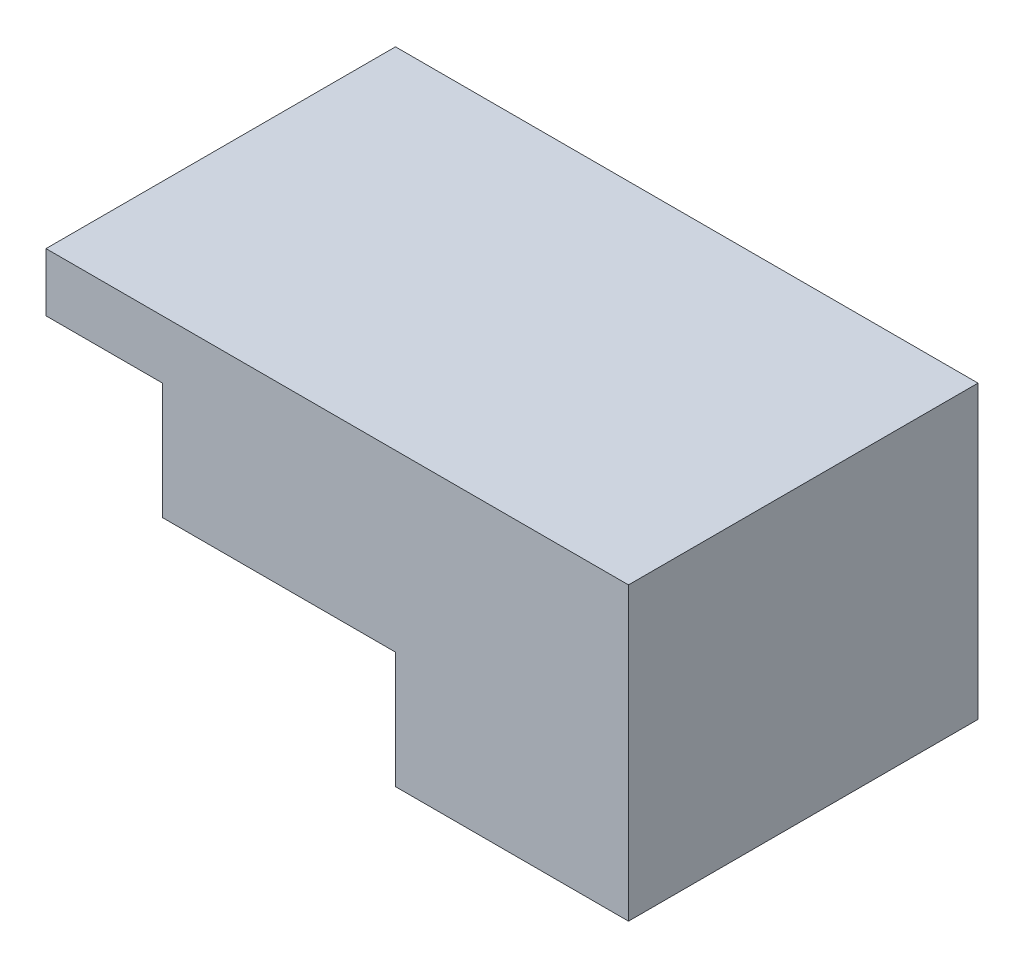
ISO-10303-21;
HEADER;
FILE_DESCRIPTION(('STEP AP214'),'2;1');
FILE_NAME('part.step','',(''),(''),'','','');
FILE_SCHEMA(('AUTOMOTIVE_DESIGN { 1 0 10303 214 1 1 1 1 }'));
ENDSEC;
DATA;
#1=APPLICATION_CONTEXT('core data for automotive mechanical design processes');
#2=APPLICATION_PROTOCOL_DEFINITION('international standard','automotive_design',2000,#1);
#3=PRODUCT_CONTEXT('',#1,'mechanical');
#4=PRODUCT('Part','Part','',(#3));
#5=PRODUCT_RELATED_PRODUCT_CATEGORY('part','',(#4));
#6=PRODUCT_DEFINITION_FORMATION('','',#4);
#7=PRODUCT_DEFINITION_CONTEXT('part definition',#1,'design');
#8=PRODUCT_DEFINITION('design','',#6,#7);
#9=PRODUCT_DEFINITION_SHAPE('','',#8);
#10=(LENGTH_UNIT() NAMED_UNIT(*) SI_UNIT(.MILLI.,.METRE.));
#11=(NAMED_UNIT(*) PLANE_ANGLE_UNIT() SI_UNIT($,.RADIAN.));
#12=(NAMED_UNIT(*) SI_UNIT($,.STERADIAN.) SOLID_ANGLE_UNIT());
#13=UNCERTAINTY_MEASURE_WITH_UNIT(LENGTH_MEASURE(1.E-05),#10,'distance_accuracy_value','');
#14=(GEOMETRIC_REPRESENTATION_CONTEXT(3) GLOBAL_UNCERTAINTY_ASSIGNED_CONTEXT((#13)) GLOBAL_UNIT_ASSIGNED_CONTEXT((#10,
#11,#12)) REPRESENTATION_CONTEXT('',''));
#15=CARTESIAN_POINT('',(0.,0.,0.));
#16=DIRECTION('',(0.,0.,1.));
#17=DIRECTION('',(1.,0.,0.));
#18=AXIS2_PLACEMENT_3D('',#15,#16,#17);
#19=CARTESIAN_POINT('',(-101.6,0.,-152.4));
#20=DIRECTION('',(0.,-1.,0.));
#21=DIRECTION('',(0.,0.,-1.));
#22=AXIS2_PLACEMENT_3D('',#19,#20,#21);
#23=PLANE('',#22);
#24=DIRECTION('',(1.,0.,0.));
#25=VECTOR('',#24,1.);
#26=CARTESIAN_POINT('',(-101.6,0.,0.));
#27=LINE('',#26,#25);
#28=CARTESIAN_POINT('',(-101.6,0.,0.));
#29=VERTEX_POINT('',#28);
#30=CARTESIAN_POINT('',(0.,0.,0.));
#31=VERTEX_POINT('',#30);
#32=EDGE_CURVE('E128',#29,#31,#27,.T.);
#33=ORIENTED_EDGE('',*,*,#32,.F.);
#34=DIRECTION('',(0.,0.,1.));
#35=VECTOR('',#34,1.);
#36=CARTESIAN_POINT('',(-101.6,0.,-152.4));
#37=LINE('',#36,#35);
#38=CARTESIAN_POINT('',(-101.6,0.,-152.4));
#39=VERTEX_POINT('',#38);
#40=EDGE_CURVE('E11',#39,#29,#37,.T.);
#41=ORIENTED_EDGE('',*,*,#40,.F.);
#42=DIRECTION('',(1.,0.,0.));
#43=VECTOR('',#42,1.);
#44=CARTESIAN_POINT('',(-101.6,0.,-152.4));
#45=LINE('',#44,#43);
#46=CARTESIAN_POINT('',(0.,0.,-152.4));
#47=VERTEX_POINT('',#46);
#48=EDGE_CURVE('E148',#39,#47,#45,.T.);
#49=ORIENTED_EDGE('',*,*,#48,.T.);
#50=DIRECTION('',(0.,0.,1.));
#51=VECTOR('',#50,1.);
#52=CARTESIAN_POINT('',(0.,0.,-152.4));
#53=LINE('',#52,#51);
#54=EDGE_CURVE('E34',#47,#31,#53,.T.);
#55=ORIENTED_EDGE('',*,*,#54,.T.);
#56=EDGE_LOOP('',(#33,#41,#49,#55));
#57=FACE_BOUND('',#56,.T.);
#58=ADVANCED_FACE('F31',(#57),#23,.T.);
#59=CARTESIAN_POINT('',(-101.6,50.8,-152.4));
#60=DIRECTION('',(-1.,0.,0.));
#61=DIRECTION('',(0.,0.,1.));
#62=AXIS2_PLACEMENT_3D('',#59,#60,#61);
#63=PLANE('',#62);
#64=DIRECTION('',(0.,-1.,0.));
#65=VECTOR('',#64,1.);
#66=CARTESIAN_POINT('',(-101.6,50.8,0.));
#67=LINE('',#66,#65);
#68=CARTESIAN_POINT('',(-101.6,50.8,0.));
#69=VERTEX_POINT('',#68);
#70=EDGE_CURVE('E146',#69,#29,#67,.T.);
#71=ORIENTED_EDGE('',*,*,#70,.F.);
#72=DIRECTION('',(0.,0.,1.));
#73=VECTOR('',#72,1.);
#74=CARTESIAN_POINT('',(-101.6,50.8,-152.4));
#75=LINE('',#74,#73);
#76=CARTESIAN_POINT('',(-101.6,50.8,-152.4));
#77=VERTEX_POINT('',#76);
#78=EDGE_CURVE('E40',#77,#69,#75,.T.);
#79=ORIENTED_EDGE('',*,*,#78,.F.);
#80=DIRECTION('',(0.,-1.,0.));
#81=VECTOR('',#80,1.);
#82=CARTESIAN_POINT('',(-101.6,50.8,-152.4));
#83=LINE('',#82,#81);
#84=EDGE_CURVE('E118',#77,#39,#83,.T.);
#85=ORIENTED_EDGE('',*,*,#84,.T.);
#86=ORIENTED_EDGE('',*,*,#40,.T.);
#87=EDGE_LOOP('',(#71,#79,#85,#86));
#88=FACE_BOUND('',#87,.T.);
#89=ADVANCED_FACE('F160',(#88),#63,.T.);
#90=CARTESIAN_POINT('',(-152.4,50.8,-152.4));
#91=DIRECTION('',(0.,-1.,0.));
#92=DIRECTION('',(0.,0.,-1.));
#93=AXIS2_PLACEMENT_3D('',#90,#91,#92);
#94=PLANE('',#93);
#95=DIRECTION('',(1.,0.,0.));
#96=VECTOR('',#95,1.);
#97=CARTESIAN_POINT('',(-152.4,50.8,0.));
#98=LINE('',#97,#96);
#99=CARTESIAN_POINT('',(-152.4,50.8,0.));
#100=VERTEX_POINT('',#99);
#101=EDGE_CURVE('E105',#100,#69,#98,.T.);
#102=ORIENTED_EDGE('',*,*,#101,.F.);
#103=DIRECTION('',(0.,0.,1.));
#104=VECTOR('',#103,1.);
#105=CARTESIAN_POINT('',(-152.4,50.8,-152.4));
#106=LINE('',#105,#104);
#107=CARTESIAN_POINT('',(-152.4,50.8,-152.4));
#108=VERTEX_POINT('',#107);
#109=EDGE_CURVE('E100',#108,#100,#106,.T.);
#110=ORIENTED_EDGE('',*,*,#109,.F.);
#111=DIRECTION('',(1.,0.,0.));
#112=VECTOR('',#111,1.);
#113=CARTESIAN_POINT('',(-152.4,50.8,-152.4));
#114=LINE('',#113,#112);
#115=EDGE_CURVE('E103',#108,#77,#114,.T.);
#116=ORIENTED_EDGE('',*,*,#115,.T.);
#117=ORIENTED_EDGE('',*,*,#78,.T.);
#118=EDGE_LOOP('',(#102,#110,#116,#117));
#119=FACE_BOUND('',#118,.T.);
#120=ADVANCED_FACE('F102',(#119),#94,.T.);
#121=CARTESIAN_POINT('',(-152.4,76.2,-152.4));
#122=DIRECTION('',(-1.,0.,0.));
#123=DIRECTION('',(0.,-1.,0.));
#124=AXIS2_PLACEMENT_3D('',#121,#122,#123);
#125=PLANE('',#124);
#126=DIRECTION('',(0.,-1.,0.));
#127=VECTOR('',#126,1.);
#128=CARTESIAN_POINT('',(-152.4,76.2,0.));
#129=LINE('',#128,#127);
#130=CARTESIAN_POINT('',(-152.4,76.2,0.));
#131=VERTEX_POINT('',#130);
#132=EDGE_CURVE('E143',#131,#100,#129,.T.);
#133=ORIENTED_EDGE('',*,*,#132,.F.);
#134=DIRECTION('',(0.,0.,1.));
#135=VECTOR('',#134,1.);
#136=CARTESIAN_POINT('',(-152.4,76.2,-152.4));
#137=LINE('',#136,#135);
#138=CARTESIAN_POINT('',(-152.4,76.2,-152.4));
#139=VERTEX_POINT('',#138);
#140=EDGE_CURVE('E110',#139,#131,#137,.T.);
#141=ORIENTED_EDGE('',*,*,#140,.F.);
#142=DIRECTION('',(0.,-1.,0.));
#143=VECTOR('',#142,1.);
#144=CARTESIAN_POINT('',(-152.4,76.2,-152.4));
#145=LINE('',#144,#143);
#146=EDGE_CURVE('E116',#139,#108,#145,.T.);
#147=ORIENTED_EDGE('',*,*,#146,.T.);
#148=ORIENTED_EDGE('',*,*,#109,.T.);
#149=EDGE_LOOP('',(#133,#141,#147,#148));
#150=FACE_BOUND('',#149,.T.);
#151=ADVANCED_FACE('F120',(#150),#125,.T.);
#152=CARTESIAN_POINT('',(101.6,76.2,-152.4));
#153=DIRECTION('',(0.,1.,0.));
#154=DIRECTION('',(-1.,0.,0.));
#155=AXIS2_PLACEMENT_3D('',#152,#153,#154);
#156=PLANE('',#155);
#157=DIRECTION('',(-1.,0.,0.));
#158=VECTOR('',#157,1.);
#159=CARTESIAN_POINT('',(101.6,76.2,0.));
#160=LINE('',#159,#158);
#161=CARTESIAN_POINT('',(101.6,76.2,0.));
#162=VERTEX_POINT('',#161);
#163=EDGE_CURVE('E140',#162,#131,#160,.T.);
#164=ORIENTED_EDGE('',*,*,#163,.F.);
#165=DIRECTION('',(0.,0.,1.));
#166=VECTOR('',#165,1.);
#167=CARTESIAN_POINT('',(101.6,76.2,-152.4));
#168=LINE('',#167,#166);
#169=CARTESIAN_POINT('',(101.6,76.2,-152.4));
#170=VERTEX_POINT('',#169);
#171=EDGE_CURVE('E152',#170,#162,#168,.T.);
#172=ORIENTED_EDGE('',*,*,#171,.F.);
#173=DIRECTION('',(-1.,0.,0.));
#174=VECTOR('',#173,1.);
#175=CARTESIAN_POINT('',(101.6,76.2,-152.4));
#176=LINE('',#175,#174);
#177=EDGE_CURVE('E121',#170,#139,#176,.T.);
#178=ORIENTED_EDGE('',*,*,#177,.T.);
#179=ORIENTED_EDGE('',*,*,#140,.T.);
#180=EDGE_LOOP('',(#164,#172,#178,#179));
#181=FACE_BOUND('',#180,.T.);
#182=ADVANCED_FACE('F173',(#181),#156,.T.);
#183=CARTESIAN_POINT('',(101.6,-50.8,-152.4));
#184=DIRECTION('',(1.,0.,0.));
#185=DIRECTION('',(0.,0.,-1.));
#186=AXIS2_PLACEMENT_3D('',#183,#184,#185);
#187=PLANE('',#186);
#188=DIRECTION('',(0.,1.,0.));
#189=VECTOR('',#188,1.);
#190=CARTESIAN_POINT('',(101.6,-50.8,0.));
#191=LINE('',#190,#189);
#192=CARTESIAN_POINT('',(101.6,-50.8,0.));
#193=VERTEX_POINT('',#192);
#194=EDGE_CURVE('E137',#193,#162,#191,.T.);
#195=ORIENTED_EDGE('',*,*,#194,.F.);
#196=DIRECTION('',(0.,0.,1.));
#197=VECTOR('',#196,1.);
#198=CARTESIAN_POINT('',(101.6,-50.8,-152.4));
#199=LINE('',#198,#197);
#200=CARTESIAN_POINT('',(101.6,-50.8,-152.4));
#201=VERTEX_POINT('',#200);
#202=EDGE_CURVE('E154',#201,#193,#199,.T.);
#203=ORIENTED_EDGE('',*,*,#202,.F.);
#204=DIRECTION('',(0.,1.,0.));
#205=VECTOR('',#204,1.);
#206=CARTESIAN_POINT('',(101.6,-50.8,-152.4));
#207=LINE('',#206,#205);
#208=EDGE_CURVE('E123',#201,#170,#207,.T.);
#209=ORIENTED_EDGE('',*,*,#208,.T.);
#210=ORIENTED_EDGE('',*,*,#171,.T.);
#211=EDGE_LOOP('',(#195,#203,#209,#210));
#212=FACE_BOUND('',#211,.T.);
#213=ADVANCED_FACE('F176',(#212),#187,.T.);
#214=CARTESIAN_POINT('',(0.,-50.8,-152.4));
#215=DIRECTION('',(0.,-1.,0.));
#216=DIRECTION('',(0.,0.,-1.));
#217=AXIS2_PLACEMENT_3D('',#214,#215,#216);
#218=PLANE('',#217);
#219=DIRECTION('',(1.,0.,0.));
#220=VECTOR('',#219,1.);
#221=CARTESIAN_POINT('',(0.,-50.8,0.));
#222=LINE('',#221,#220);
#223=CARTESIAN_POINT('',(0.,-50.8,0.));
#224=VERTEX_POINT('',#223);
#225=EDGE_CURVE('E134',#224,#193,#222,.T.);
#226=ORIENTED_EDGE('',*,*,#225,.F.);
#227=DIRECTION('',(0.,0.,1.));
#228=VECTOR('',#227,1.);
#229=CARTESIAN_POINT('',(0.,-50.8,-152.4));
#230=LINE('',#229,#228);
#231=CARTESIAN_POINT('',(0.,-50.8,-152.4));
#232=VERTEX_POINT('',#231);
#233=EDGE_CURVE('E155',#232,#224,#230,.T.);
#234=ORIENTED_EDGE('',*,*,#233,.F.);
#235=DIRECTION('',(1.,0.,0.));
#236=VECTOR('',#235,1.);
#237=CARTESIAN_POINT('',(0.,-50.8,-152.4));
#238=LINE('',#237,#236);
#239=EDGE_CURVE('E251',#232,#201,#238,.T.);
#240=ORIENTED_EDGE('',*,*,#239,.T.);
#241=ORIENTED_EDGE('',*,*,#202,.T.);
#242=EDGE_LOOP('',(#226,#234,#240,#241));
#243=FACE_BOUND('',#242,.T.);
#244=ADVANCED_FACE('F180',(#243),#218,.T.);
#245=CARTESIAN_POINT('',(0.,0.,-152.4));
#246=DIRECTION('',(-1.,0.,0.));
#247=DIRECTION('',(0.,-1.,0.));
#248=AXIS2_PLACEMENT_3D('',#245,#246,#247);
#249=PLANE('',#248);
#250=DIRECTION('',(0.,-1.,0.));
#251=VECTOR('',#250,1.);
#252=CARTESIAN_POINT('',(0.,0.,0.));
#253=LINE('',#252,#251);
#254=EDGE_CURVE('E131',#31,#224,#253,.T.);
#255=ORIENTED_EDGE('',*,*,#254,.F.);
#256=ORIENTED_EDGE('',*,*,#54,.F.);
#257=DIRECTION('',(0.,-1.,0.));
#258=VECTOR('',#257,1.);
#259=CARTESIAN_POINT('',(0.,0.,-152.4));
#260=LINE('',#259,#258);
#261=EDGE_CURVE('E252',#47,#232,#260,.T.);
#262=ORIENTED_EDGE('',*,*,#261,.T.);
#263=ORIENTED_EDGE('',*,*,#233,.T.);
#264=EDGE_LOOP('',(#255,#256,#262,#263));
#265=FACE_BOUND('',#264,.T.);
#266=ADVANCED_FACE('F157',(#265),#249,.T.);
#267=CARTESIAN_POINT('',(0.,0.,-152.4));
#268=DIRECTION('',(0.,0.,-1.));
#269=DIRECTION('',(-1.,0.,0.));
#270=AXIS2_PLACEMENT_3D('',#267,#268,#269);
#271=PLANE('',#270);
#272=ORIENTED_EDGE('',*,*,#48,.F.);
#273=ORIENTED_EDGE('',*,*,#84,.F.);
#274=ORIENTED_EDGE('',*,*,#115,.F.);
#275=ORIENTED_EDGE('',*,*,#146,.F.);
#276=ORIENTED_EDGE('',*,*,#177,.F.);
#277=ORIENTED_EDGE('',*,*,#208,.F.);
#278=ORIENTED_EDGE('',*,*,#239,.F.);
#279=ORIENTED_EDGE('',*,*,#261,.F.);
#280=EDGE_LOOP('',(#272,#273,#274,#275,#276,#277,#278,#279));
#281=FACE_BOUND('',#280,.T.);
#282=ADVANCED_FACE('F114',(#281),#271,.T.);
#283=CARTESIAN_POINT('',(0.,0.,0.));
#284=DIRECTION('',(0.,0.,-1.));
#285=DIRECTION('',(-1.,0.,0.));
#286=AXIS2_PLACEMENT_3D('',#283,#284,#285);
#287=PLANE('',#286);
#288=ORIENTED_EDGE('',*,*,#32,.T.);
#289=ORIENTED_EDGE('',*,*,#254,.T.);
#290=ORIENTED_EDGE('',*,*,#225,.T.);
#291=ORIENTED_EDGE('',*,*,#194,.T.);
#292=ORIENTED_EDGE('',*,*,#163,.T.);
#293=ORIENTED_EDGE('',*,*,#132,.T.);
#294=ORIENTED_EDGE('',*,*,#101,.T.);
#295=ORIENTED_EDGE('',*,*,#70,.T.);
#296=EDGE_LOOP('',(#288,#289,#290,#291,#292,#293,#294,#295));
#297=FACE_BOUND('',#296,.T.);
#298=ADVANCED_FACE('F159',(#297),#287,.F.);
#299=CLOSED_SHELL('',(#58,#89,#120,#151,#182,#213,#244,#266,#282,#298));
#300=MANIFOLD_SOLID_BREP('B2',#299);
#301=ADVANCED_BREP_SHAPE_REPRESENTATION('',(#18,#300),#14);
#302=SHAPE_DEFINITION_REPRESENTATION(#9,#301);
ENDSEC;
END-ISO-10303-21;
